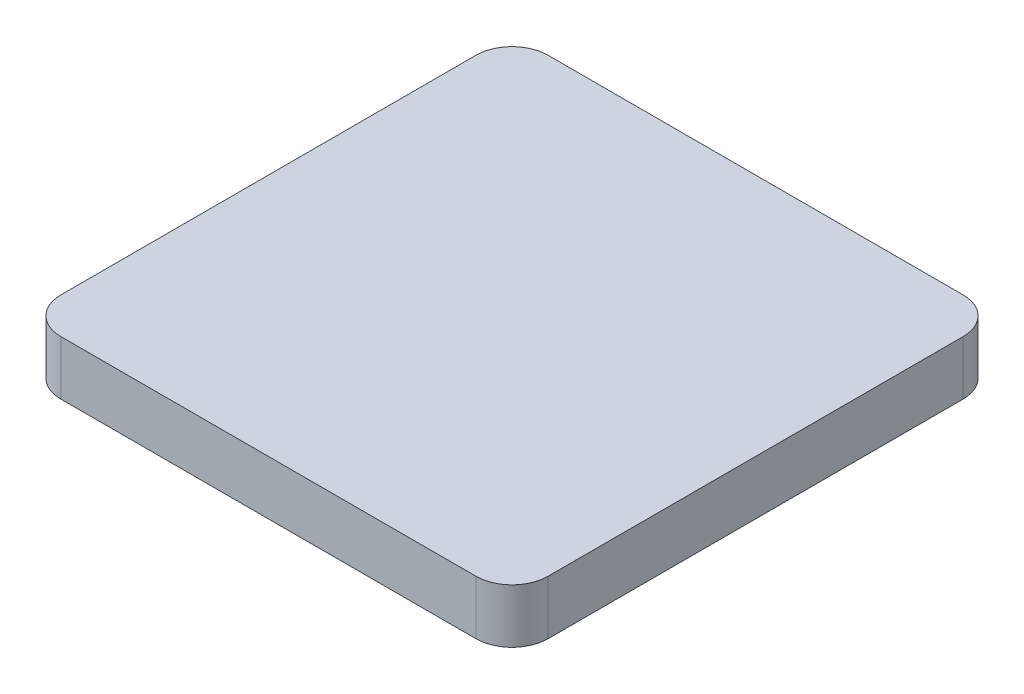
ISO-10303-21;
HEADER;
FILE_DESCRIPTION(('STEP AP214'),'2;1');
FILE_NAME('part.step','',(''),(''),'','','');
FILE_SCHEMA(('AUTOMOTIVE_DESIGN { 1 0 10303 214 1 1 1 1 }'));
ENDSEC;
DATA;
#1=APPLICATION_CONTEXT('core data for automotive mechanical design processes');
#2=APPLICATION_PROTOCOL_DEFINITION('international standard','automotive_design',2000,#1);
#3=PRODUCT_CONTEXT('',#1,'mechanical');
#4=PRODUCT('Part','Part','',(#3));
#5=PRODUCT_RELATED_PRODUCT_CATEGORY('part','',(#4));
#6=PRODUCT_DEFINITION_FORMATION('','',#4);
#7=PRODUCT_DEFINITION_CONTEXT('part definition',#1,'design');
#8=PRODUCT_DEFINITION('design','',#6,#7);
#9=PRODUCT_DEFINITION_SHAPE('','',#8);
#10=(LENGTH_UNIT() NAMED_UNIT(*) SI_UNIT(.MILLI.,.METRE.));
#11=(NAMED_UNIT(*) PLANE_ANGLE_UNIT() SI_UNIT($,.RADIAN.));
#12=(NAMED_UNIT(*) SI_UNIT($,.STERADIAN.) SOLID_ANGLE_UNIT());
#13=UNCERTAINTY_MEASURE_WITH_UNIT(LENGTH_MEASURE(1.E-05),#10,'distance_accuracy_value','');
#14=(GEOMETRIC_REPRESENTATION_CONTEXT(3) GLOBAL_UNCERTAINTY_ASSIGNED_CONTEXT((#13)) GLOBAL_UNIT_ASSIGNED_CONTEXT((#10,
#11,#12)) REPRESENTATION_CONTEXT('',''));
#15=CARTESIAN_POINT('',(0.,0.,0.));
#16=DIRECTION('',(0.,0.,1.));
#17=DIRECTION('',(1.,0.,0.));
#18=AXIS2_PLACEMENT_3D('',#15,#16,#17);
#19=CARTESIAN_POINT('',(-13.5,-20.5001,17.5));
#20=DIRECTION('',(1.,0.,0.));
#21=DIRECTION('',(0.,0.,-1.));
#22=AXIS2_PLACEMENT_3D('',#19,#20,#21);
#23=PLANE('',#22);
#24=DIRECTION('',(0.,0.,-1.));
#25=VECTOR('',#24,1.);
#26=CARTESIAN_POINT('',(-13.5,-17.5001,17.5));
#27=LINE('',#26,#25);
#28=CARTESIAN_POINT('',(-13.5,-17.5001,15.5));
#29=VERTEX_POINT('',#28);
#30=CARTESIAN_POINT('',(-13.5,-17.5001,-7.5));
#31=VERTEX_POINT('',#30);
#32=EDGE_CURVE('E129',#29,#31,#27,.T.);
#33=ORIENTED_EDGE('',*,*,#32,.T.);
#34=DIRECTION('',(0.,1.,0.));
#35=VECTOR('',#34,1.);
#36=CARTESIAN_POINT('',(-13.5,-20.5001,-7.5));
#37=LINE('',#36,#35);
#38=CARTESIAN_POINT('',(-13.5,-20.5001,-7.5));
#39=VERTEX_POINT('',#38);
#40=EDGE_CURVE('E152',#31,#39,#37,.F.);
#41=ORIENTED_EDGE('',*,*,#40,.T.);
#42=DIRECTION('',(0.,0.,-1.));
#43=VECTOR('',#42,1.);
#44=CARTESIAN_POINT('',(-13.5,-20.5001,17.5));
#45=LINE('',#44,#43);
#46=CARTESIAN_POINT('',(-13.5,-20.5001,15.5));
#47=VERTEX_POINT('',#46);
#48=EDGE_CURVE('E127',#47,#39,#45,.T.);
#49=ORIENTED_EDGE('',*,*,#48,.F.);
#50=DIRECTION('',(0.,1.,0.));
#51=VECTOR('',#50,1.);
#52=CARTESIAN_POINT('',(-13.5,-20.5001,15.5));
#53=LINE('',#52,#51);
#54=EDGE_CURVE('E149',#47,#29,#53,.T.);
#55=ORIENTED_EDGE('',*,*,#54,.T.);
#56=EDGE_LOOP('',(#33,#41,#49,#55));
#57=FACE_BOUND('',#56,.T.);
#58=ADVANCED_FACE('F34',(#57),#23,.F.);
#59=CARTESIAN_POINT('',(-13.5,-20.5001,-9.5));
#60=DIRECTION('',(0.,0.,1.));
#61=DIRECTION('',(1.,0.,0.));
#62=AXIS2_PLACEMENT_3D('',#59,#60,#61);
#63=PLANE('',#62);
#64=DIRECTION('',(1.,0.,0.));
#65=VECTOR('',#64,1.);
#66=CARTESIAN_POINT('',(-13.5,-17.5001,-9.5));
#67=LINE('',#66,#65);
#68=CARTESIAN_POINT('',(-11.5,-17.5001,-9.5));
#69=VERTEX_POINT('',#68);
#70=CARTESIAN_POINT('',(11.5,-17.5001,-9.5));
#71=VERTEX_POINT('',#70);
#72=EDGE_CURVE('E125',#69,#71,#67,.T.);
#73=ORIENTED_EDGE('',*,*,#72,.T.);
#74=DIRECTION('',(0.,1.,0.));
#75=VECTOR('',#74,1.);
#76=CARTESIAN_POINT('',(11.5,-20.5001,-9.5));
#77=LINE('',#76,#75);
#78=CARTESIAN_POINT('',(11.5,-20.5001,-9.5));
#79=VERTEX_POINT('',#78);
#80=EDGE_CURVE('E104',#71,#79,#77,.F.);
#81=ORIENTED_EDGE('',*,*,#80,.T.);
#82=DIRECTION('',(1.,0.,0.));
#83=VECTOR('',#82,1.);
#84=CARTESIAN_POINT('',(-13.5,-20.5001,-9.5));
#85=LINE('',#84,#83);
#86=CARTESIAN_POINT('',(-11.5,-20.5001,-9.5));
#87=VERTEX_POINT('',#86);
#88=EDGE_CURVE('E168',#87,#79,#85,.T.);
#89=ORIENTED_EDGE('',*,*,#88,.F.);
#90=DIRECTION('',(0.,1.,0.));
#91=VECTOR('',#90,1.);
#92=CARTESIAN_POINT('',(-11.5,-20.5001,-9.5));
#93=LINE('',#92,#91);
#94=EDGE_CURVE('E109',#87,#69,#93,.T.);
#95=ORIENTED_EDGE('',*,*,#94,.T.);
#96=EDGE_LOOP('',(#73,#81,#89,#95));
#97=FACE_BOUND('',#96,.T.);
#98=ADVANCED_FACE('F185',(#97),#63,.F.);
#99=CARTESIAN_POINT('',(13.5,-20.5001,17.5));
#100=DIRECTION('',(-1.,0.,0.));
#101=DIRECTION('',(0.,0.,1.));
#102=AXIS2_PLACEMENT_3D('',#99,#100,#101);
#103=PLANE('',#102);
#104=DIRECTION('',(0.,0.,1.));
#105=VECTOR('',#104,1.);
#106=CARTESIAN_POINT('',(13.5,-20.5001,17.5));
#107=LINE('',#106,#105);
#108=CARTESIAN_POINT('',(13.5,-20.5001,-7.5));
#109=VERTEX_POINT('',#108);
#110=CARTESIAN_POINT('',(13.5,-20.5001,15.5));
#111=VERTEX_POINT('',#110);
#112=EDGE_CURVE('E118',#109,#111,#107,.T.);
#113=ORIENTED_EDGE('',*,*,#112,.F.);
#114=DIRECTION('',(0.,1.,0.));
#115=VECTOR('',#114,1.);
#116=CARTESIAN_POINT('',(13.5,-20.5001,-7.5));
#117=LINE('',#116,#115);
#118=CARTESIAN_POINT('',(13.5,-17.5001,-7.5));
#119=VERTEX_POINT('',#118);
#120=EDGE_CURVE('E103',#109,#119,#117,.T.);
#121=ORIENTED_EDGE('',*,*,#120,.T.);
#122=DIRECTION('',(0.,0.,1.));
#123=VECTOR('',#122,1.);
#124=CARTESIAN_POINT('',(13.5,-17.5001,17.5));
#125=LINE('',#124,#123);
#126=CARTESIAN_POINT('',(13.5,-17.5001,15.5));
#127=VERTEX_POINT('',#126);
#128=EDGE_CURVE('E116',#119,#127,#125,.T.);
#129=ORIENTED_EDGE('',*,*,#128,.T.);
#130=DIRECTION('',(0.,1.,0.));
#131=VECTOR('',#130,1.);
#132=CARTESIAN_POINT('',(13.5,-20.5001,15.5));
#133=LINE('',#132,#131);
#134=EDGE_CURVE('E120',#127,#111,#133,.F.);
#135=ORIENTED_EDGE('',*,*,#134,.T.);
#136=EDGE_LOOP('',(#113,#121,#129,#135));
#137=FACE_BOUND('',#136,.T.);
#138=ADVANCED_FACE('F115',(#137),#103,.F.);
#139=CARTESIAN_POINT('',(-13.5,-20.5001,17.5));
#140=DIRECTION('',(0.,0.,-1.));
#141=DIRECTION('',(-1.,0.,0.));
#142=AXIS2_PLACEMENT_3D('',#139,#140,#141);
#143=PLANE('',#142);
#144=DIRECTION('',(-1.,0.,0.));
#145=VECTOR('',#144,1.);
#146=CARTESIAN_POINT('',(-13.5,-17.5001,17.5));
#147=LINE('',#146,#145);
#148=CARTESIAN_POINT('',(11.5,-17.5001,17.5));
#149=VERTEX_POINT('',#148);
#150=CARTESIAN_POINT('',(-11.5,-17.5001,17.5));
#151=VERTEX_POINT('',#150);
#152=EDGE_CURVE('E124',#149,#151,#147,.T.);
#153=ORIENTED_EDGE('',*,*,#152,.T.);
#154=DIRECTION('',(0.,1.,0.));
#155=VECTOR('',#154,1.);
#156=CARTESIAN_POINT('',(-11.5,-20.5001,17.5));
#157=LINE('',#156,#155);
#158=CARTESIAN_POINT('',(-11.5,-20.5001,17.5));
#159=VERTEX_POINT('',#158);
#160=EDGE_CURVE('E11',#151,#159,#157,.F.);
#161=ORIENTED_EDGE('',*,*,#160,.T.);
#162=DIRECTION('',(-1.,0.,0.));
#163=VECTOR('',#162,1.);
#164=CARTESIAN_POINT('',(-13.5,-20.5001,17.5));
#165=LINE('',#164,#163);
#166=CARTESIAN_POINT('',(11.5,-20.5001,17.5));
#167=VERTEX_POINT('',#166);
#168=EDGE_CURVE('E133',#167,#159,#165,.T.);
#169=ORIENTED_EDGE('',*,*,#168,.F.);
#170=DIRECTION('',(0.,1.,0.));
#171=VECTOR('',#170,1.);
#172=CARTESIAN_POINT('',(11.5,-20.5001,17.5));
#173=LINE('',#172,#171);
#174=EDGE_CURVE('E42',#167,#149,#173,.T.);
#175=ORIENTED_EDGE('',*,*,#174,.T.);
#176=EDGE_LOOP('',(#153,#161,#169,#175));
#177=FACE_BOUND('',#176,.T.);
#178=ADVANCED_FACE('F155',(#177),#143,.F.);
#179=CARTESIAN_POINT('',(-110.,-20.5001,0.));
#180=DIRECTION('',(0.,-1.,0.));
#181=DIRECTION('',(0.,0.,-1.));
#182=AXIS2_PLACEMENT_3D('',#179,#180,#181);
#183=PLANE('',#182);
#184=ORIENTED_EDGE('',*,*,#88,.T.);
#185=CARTESIAN_POINT('',(11.5,-20.5001,-7.5));
#186=DIRECTION('',(0.,-1.,0.));
#187=DIRECTION('',(0.,0.,-1.));
#188=AXIS2_PLACEMENT_3D('',#185,#186,#187);
#189=CIRCLE('',#188,2.);
#190=EDGE_CURVE('E147',#79,#109,#189,.T.);
#191=ORIENTED_EDGE('',*,*,#190,.T.);
#192=ORIENTED_EDGE('',*,*,#112,.T.);
#193=CARTESIAN_POINT('',(11.5,-20.5001,15.5));
#194=DIRECTION('',(0.,-1.,0.));
#195=DIRECTION('',(0.,0.,-1.));
#196=AXIS2_PLACEMENT_3D('',#193,#194,#195);
#197=CIRCLE('',#196,2.);
#198=EDGE_CURVE('E54',#111,#167,#197,.T.);
#199=ORIENTED_EDGE('',*,*,#198,.T.);
#200=ORIENTED_EDGE('',*,*,#168,.T.);
#201=CARTESIAN_POINT('',(-11.5,-20.5001,15.5));
#202=DIRECTION('',(0.,-1.,0.));
#203=DIRECTION('',(0.,0.,-1.));
#204=AXIS2_PLACEMENT_3D('',#201,#202,#203);
#205=CIRCLE('',#204,2.);
#206=EDGE_CURVE('E143',#159,#47,#205,.T.);
#207=ORIENTED_EDGE('',*,*,#206,.T.);
#208=ORIENTED_EDGE('',*,*,#48,.T.);
#209=CARTESIAN_POINT('',(-11.5,-20.5001,-7.5));
#210=DIRECTION('',(0.,-1.,0.));
#211=DIRECTION('',(0.,0.,-1.));
#212=AXIS2_PLACEMENT_3D('',#209,#210,#211);
#213=CIRCLE('',#212,2.);
#214=EDGE_CURVE('E145',#39,#87,#213,.T.);
#215=ORIENTED_EDGE('',*,*,#214,.T.);
#216=EDGE_LOOP('',(#184,#191,#192,#199,#200,#207,#208,#215));
#217=FACE_BOUND('',#216,.T.);
#218=ADVANCED_FACE('F174',(#217),#183,.T.);
#219=CARTESIAN_POINT('',(-110.,-17.5001,0.));
#220=DIRECTION('',(0.,-1.,0.));
#221=DIRECTION('',(0.,0.,-1.));
#222=AXIS2_PLACEMENT_3D('',#219,#220,#221);
#223=PLANE('',#222);
#224=ORIENTED_EDGE('',*,*,#128,.F.);
#225=CARTESIAN_POINT('',(11.5,-17.5001,-7.5));
#226=DIRECTION('',(0.,-1.,0.));
#227=DIRECTION('',(0.,0.,-1.));
#228=AXIS2_PLACEMENT_3D('',#225,#226,#227);
#229=CIRCLE('',#228,2.);
#230=EDGE_CURVE('E99',#119,#71,#229,.F.);
#231=ORIENTED_EDGE('',*,*,#230,.T.);
#232=ORIENTED_EDGE('',*,*,#72,.F.);
#233=CARTESIAN_POINT('',(-11.5,-17.5001,-7.5));
#234=DIRECTION('',(0.,-1.,0.));
#235=DIRECTION('',(0.,0.,-1.));
#236=AXIS2_PLACEMENT_3D('',#233,#234,#235);
#237=CIRCLE('',#236,2.);
#238=EDGE_CURVE('E110',#69,#31,#237,.F.);
#239=ORIENTED_EDGE('',*,*,#238,.T.);
#240=ORIENTED_EDGE('',*,*,#32,.F.);
#241=CARTESIAN_POINT('',(-11.5,-17.5001,15.5));
#242=DIRECTION('',(0.,-1.,0.));
#243=DIRECTION('',(0.,0.,-1.));
#244=AXIS2_PLACEMENT_3D('',#241,#242,#243);
#245=CIRCLE('',#244,2.);
#246=EDGE_CURVE('E136',#29,#151,#245,.F.);
#247=ORIENTED_EDGE('',*,*,#246,.T.);
#248=ORIENTED_EDGE('',*,*,#152,.F.);
#249=CARTESIAN_POINT('',(11.5,-17.5001,15.5));
#250=DIRECTION('',(0.,-1.,0.));
#251=DIRECTION('',(0.,0.,-1.));
#252=AXIS2_PLACEMENT_3D('',#249,#250,#251);
#253=CIRCLE('',#252,2.);
#254=EDGE_CURVE('E119',#149,#127,#253,.F.);
#255=ORIENTED_EDGE('',*,*,#254,.T.);
#256=EDGE_LOOP('',(#224,#231,#232,#239,#240,#247,#248,#255));
#257=FACE_BOUND('',#256,.T.);
#258=ADVANCED_FACE('F122',(#257),#223,.F.);
#259=CARTESIAN_POINT('',(11.5,-20.5001,-7.5));
#260=DIRECTION('',(0.,1.,0.));
#261=DIRECTION('',(0.,0.,1.));
#262=AXIS2_PLACEMENT_3D('',#259,#260,#261);
#263=CYLINDRICAL_SURFACE('',#262,2.);
#264=ORIENTED_EDGE('',*,*,#190,.F.);
#265=ORIENTED_EDGE('',*,*,#80,.F.);
#266=ORIENTED_EDGE('',*,*,#230,.F.);
#267=ORIENTED_EDGE('',*,*,#120,.F.);
#268=EDGE_LOOP('',(#264,#265,#266,#267));
#269=FACE_BOUND('',#268,.T.);
#270=ADVANCED_FACE('F102',(#269),#263,.T.);
#271=CARTESIAN_POINT('',(-11.5,-20.5001,-7.5));
#272=DIRECTION('',(0.,1.,0.));
#273=DIRECTION('',(0.,0.,1.));
#274=AXIS2_PLACEMENT_3D('',#271,#272,#273);
#275=CYLINDRICAL_SURFACE('',#274,2.);
#276=ORIENTED_EDGE('',*,*,#214,.F.);
#277=ORIENTED_EDGE('',*,*,#40,.F.);
#278=ORIENTED_EDGE('',*,*,#238,.F.);
#279=ORIENTED_EDGE('',*,*,#94,.F.);
#280=EDGE_LOOP('',(#276,#277,#278,#279));
#281=FACE_BOUND('',#280,.T.);
#282=ADVANCED_FACE('F196',(#281),#275,.T.);
#283=CARTESIAN_POINT('',(-11.5,-20.5001,15.5));
#284=DIRECTION('',(0.,1.,0.));
#285=DIRECTION('',(0.,0.,1.));
#286=AXIS2_PLACEMENT_3D('',#283,#284,#285);
#287=CYLINDRICAL_SURFACE('',#286,2.);
#288=ORIENTED_EDGE('',*,*,#206,.F.);
#289=ORIENTED_EDGE('',*,*,#160,.F.);
#290=ORIENTED_EDGE('',*,*,#246,.F.);
#291=ORIENTED_EDGE('',*,*,#54,.F.);
#292=EDGE_LOOP('',(#288,#289,#290,#291));
#293=FACE_BOUND('',#292,.T.);
#294=ADVANCED_FACE('F162',(#293),#287,.T.);
#295=CARTESIAN_POINT('',(11.5,-20.5001,15.5));
#296=DIRECTION('',(0.,1.,0.));
#297=DIRECTION('',(0.,0.,1.));
#298=AXIS2_PLACEMENT_3D('',#295,#296,#297);
#299=CYLINDRICAL_SURFACE('',#298,2.);
#300=ORIENTED_EDGE('',*,*,#198,.F.);
#301=ORIENTED_EDGE('',*,*,#134,.F.);
#302=ORIENTED_EDGE('',*,*,#254,.F.);
#303=ORIENTED_EDGE('',*,*,#174,.F.);
#304=EDGE_LOOP('',(#300,#301,#302,#303));
#305=FACE_BOUND('',#304,.T.);
#306=ADVANCED_FACE('F36',(#305),#299,.T.);
#307=CLOSED_SHELL('',(#58,#98,#138,#178,#218,#258,#270,#282,#294,#306));
#308=MANIFOLD_SOLID_BREP('B2',#307);
#309=ADVANCED_BREP_SHAPE_REPRESENTATION('',(#18,#308),#14);
#310=SHAPE_DEFINITION_REPRESENTATION(#9,#309);
ENDSEC;
END-ISO-10303-21;
